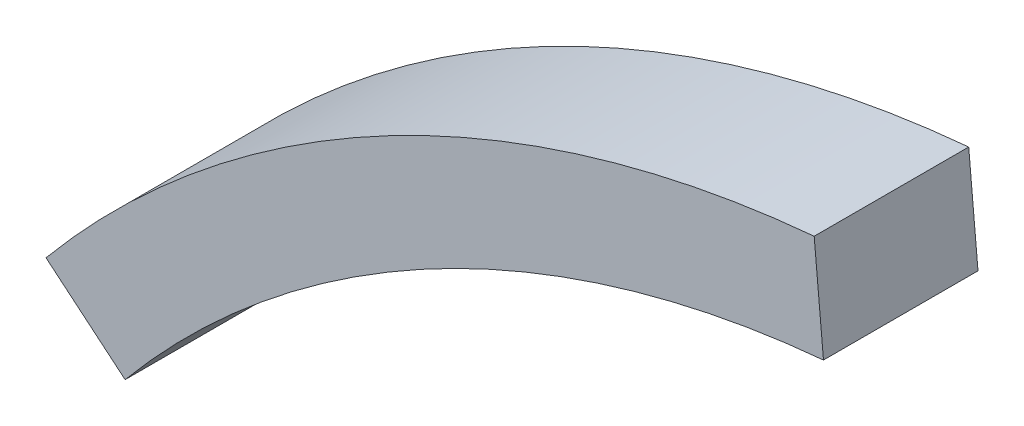
ISO-10303-21;
HEADER;
FILE_DESCRIPTION(('STEP AP214'),'2;1');
FILE_NAME('part.step','',(''),(''),'','','');
FILE_SCHEMA(('AUTOMOTIVE_DESIGN { 1 0 10303 214 1 1 1 1 }'));
ENDSEC;
DATA;
#1=APPLICATION_CONTEXT('core data for automotive mechanical design processes');
#2=APPLICATION_PROTOCOL_DEFINITION('international standard','automotive_design',2000,#1);
#3=PRODUCT_CONTEXT('',#1,'mechanical');
#4=PRODUCT('Part','Part','',(#3));
#5=PRODUCT_RELATED_PRODUCT_CATEGORY('part','',(#4));
#6=PRODUCT_DEFINITION_FORMATION('','',#4);
#7=PRODUCT_DEFINITION_CONTEXT('part definition',#1,'design');
#8=PRODUCT_DEFINITION('design','',#6,#7);
#9=PRODUCT_DEFINITION_SHAPE('','',#8);
#10=(LENGTH_UNIT() NAMED_UNIT(*) SI_UNIT(.MILLI.,.METRE.));
#11=(NAMED_UNIT(*) PLANE_ANGLE_UNIT() SI_UNIT($,.RADIAN.));
#12=(NAMED_UNIT(*) SI_UNIT($,.STERADIAN.) SOLID_ANGLE_UNIT());
#13=UNCERTAINTY_MEASURE_WITH_UNIT(LENGTH_MEASURE(1.E-05),#10,'distance_accuracy_value','');
#14=(GEOMETRIC_REPRESENTATION_CONTEXT(3) GLOBAL_UNCERTAINTY_ASSIGNED_CONTEXT((#13)) GLOBAL_UNIT_ASSIGNED_CONTEXT((#10,
#11,#12)) REPRESENTATION_CONTEXT('',''));
#15=CARTESIAN_POINT('',(0.,0.,0.));
#16=DIRECTION('',(0.,0.,1.));
#17=DIRECTION('',(1.,0.,0.));
#18=AXIS2_PLACEMENT_3D('',#15,#16,#17);
#19=CARTESIAN_POINT('',(0.,0.,3.));
#20=DIRECTION('',(0.,0.,-1.));
#21=DIRECTION('',(-1.,0.,0.));
#22=AXIS2_PLACEMENT_3D('',#19,#20,#21);
#23=CYLINDRICAL_SURFACE('',#22,20.);
#24=CARTESIAN_POINT('',(0.,0.,0.));
#25=DIRECTION('',(0.,0.,-1.));
#26=DIRECTION('',(1.,0.,0.));
#27=AXIS2_PLACEMENT_3D('',#24,#25,#26);
#28=CIRCLE('',#27,20.);
#29=CARTESIAN_POINT('',(-15.3584576206591,12.8108461669953,0.));
#30=VERTEX_POINT('',#29);
#31=CARTESIAN_POINT('',(-1.80143333471418,19.9187057295543,0.));
#32=VERTEX_POINT('',#31);
#33=EDGE_CURVE('E96',#30,#32,#28,.T.);
#34=ORIENTED_EDGE('',*,*,#33,.T.);
#35=DIRECTION('',(0.,0.,-1.));
#36=VECTOR('',#35,1.);
#37=CARTESIAN_POINT('',(-1.80143333471418,19.9187057295543,3.));
#38=LINE('',#37,#36);
#39=CARTESIAN_POINT('',(-1.80143333471418,19.9187057295543,3.));
#40=VERTEX_POINT('',#39);
#41=EDGE_CURVE('E11',#40,#32,#38,.T.);
#42=ORIENTED_EDGE('',*,*,#41,.F.);
#43=CARTESIAN_POINT('',(0.,0.,3.));
#44=DIRECTION('',(0.,0.,-1.));
#45=DIRECTION('',(1.,0.,0.));
#46=AXIS2_PLACEMENT_3D('',#43,#44,#45);
#47=CIRCLE('',#46,20.);
#48=CARTESIAN_POINT('',(-15.3584576206591,12.8108461669953,3.));
#49=VERTEX_POINT('',#48);
#50=EDGE_CURVE('E84',#49,#40,#47,.T.);
#51=ORIENTED_EDGE('',*,*,#50,.F.);
#52=DIRECTION('',(0.,0.,-1.));
#53=VECTOR('',#52,1.);
#54=CARTESIAN_POINT('',(-15.3584576206591,12.8108461669953,3.));
#55=LINE('',#54,#53);
#56=EDGE_CURVE('E92',#49,#30,#55,.T.);
#57=ORIENTED_EDGE('',*,*,#56,.T.);
#58=EDGE_LOOP('',(#34,#42,#51,#57));
#59=FACE_BOUND('',#58,.T.);
#60=ADVANCED_FACE('F33',(#59),#23,.F.);
#61=CARTESIAN_POINT('',(-1.80143333471418,19.9187057295543,3.));
#62=DIRECTION('',(-0.995935286477717,-0.0900716667357088,0.));
#63=DIRECTION('',(0.0900716667357088,-0.995935286477717,0.));
#64=AXIS2_PLACEMENT_3D('',#61,#62,#63);
#65=PLANE('',#64);
#66=DIRECTION('',(-0.0900716667357088,0.995935286477717,0.));
#67=VECTOR('',#66,1.);
#68=CARTESIAN_POINT('',(-1.80143333471418,19.9187057295543,0.));
#69=LINE('',#68,#67);
#70=CARTESIAN_POINT('',(-1.98157666818559,21.9105763025098,0.));
#71=VERTEX_POINT('',#70);
#72=EDGE_CURVE('E88',#32,#71,#69,.T.);
#73=ORIENTED_EDGE('',*,*,#72,.T.);
#74=DIRECTION('',(0.,0.,-1.));
#75=VECTOR('',#74,1.);
#76=CARTESIAN_POINT('',(-1.98157666818559,21.9105763025098,3.));
#77=LINE('',#76,#75);
#78=CARTESIAN_POINT('',(-1.98157666818559,21.9105763025098,3.));
#79=VERTEX_POINT('',#78);
#80=EDGE_CURVE('E41',#79,#71,#77,.T.);
#81=ORIENTED_EDGE('',*,*,#80,.F.);
#82=DIRECTION('',(-0.0900716667357088,0.995935286477717,0.));
#83=VECTOR('',#82,1.);
#84=CARTESIAN_POINT('',(-1.80143333471418,19.9187057295543,3.));
#85=LINE('',#84,#83);
#86=EDGE_CURVE('E79',#40,#79,#85,.T.);
#87=ORIENTED_EDGE('',*,*,#86,.F.);
#88=ORIENTED_EDGE('',*,*,#41,.T.);
#89=EDGE_LOOP('',(#73,#81,#87,#88));
#90=FACE_BOUND('',#89,.T.);
#91=ADVANCED_FACE('F87',(#90),#65,.F.);
#92=CARTESIAN_POINT('',(0.,0.,3.));
#93=DIRECTION('',(0.,0.,-1.));
#94=DIRECTION('',(-1.,0.,0.));
#95=AXIS2_PLACEMENT_3D('',#92,#93,#94);
#96=CYLINDRICAL_SURFACE('',#95,22.);
#97=CARTESIAN_POINT('',(0.,0.,0.));
#98=DIRECTION('',(0.,0.,1.));
#99=DIRECTION('',(1.,0.,0.));
#100=AXIS2_PLACEMENT_3D('',#97,#98,#99);
#101=CIRCLE('',#100,22.);
#102=CARTESIAN_POINT('',(-16.894303382725,14.0919307836948,0.));
#103=VERTEX_POINT('',#102);
#104=EDGE_CURVE('E66',#71,#103,#101,.T.);
#105=ORIENTED_EDGE('',*,*,#104,.T.);
#106=DIRECTION('',(0.,0.,-1.));
#107=VECTOR('',#106,1.);
#108=CARTESIAN_POINT('',(-16.894303382725,14.0919307836948,3.));
#109=LINE('',#108,#107);
#110=CARTESIAN_POINT('',(-16.894303382725,14.0919307836948,3.));
#111=VERTEX_POINT('',#110);
#112=EDGE_CURVE('E89',#111,#103,#109,.T.);
#113=ORIENTED_EDGE('',*,*,#112,.F.);
#114=CARTESIAN_POINT('',(0.,0.,3.));
#115=DIRECTION('',(0.,0.,1.));
#116=DIRECTION('',(1.,0.,0.));
#117=AXIS2_PLACEMENT_3D('',#114,#115,#116);
#118=CIRCLE('',#117,22.);
#119=EDGE_CURVE('E82',#79,#111,#118,.T.);
#120=ORIENTED_EDGE('',*,*,#119,.F.);
#121=ORIENTED_EDGE('',*,*,#80,.T.);
#122=EDGE_LOOP('',(#105,#113,#120,#121));
#123=FACE_BOUND('',#122,.T.);
#124=ADVANCED_FACE('F90',(#123),#96,.T.);
#125=CARTESIAN_POINT('',(-15.3584576206591,12.8108461669953,3.));
#126=DIRECTION('',(0.640542308349764,0.767922881032956,0.));
#127=DIRECTION('',(-0.767922881032956,0.640542308349764,0.));
#128=AXIS2_PLACEMENT_3D('',#125,#126,#127);
#129=PLANE('',#128);
#130=DIRECTION('',(0.767922881032956,-0.640542308349764,0.));
#131=VECTOR('',#130,1.);
#132=CARTESIAN_POINT('',(-15.3584576206591,12.8108461669953,0.));
#133=LINE('',#132,#131);
#134=EDGE_CURVE('E72',#103,#30,#133,.T.);
#135=ORIENTED_EDGE('',*,*,#134,.T.);
#136=ORIENTED_EDGE('',*,*,#56,.F.);
#137=DIRECTION('',(0.767922881032956,-0.640542308349764,0.));
#138=VECTOR('',#137,1.);
#139=CARTESIAN_POINT('',(-15.3584576206591,12.8108461669953,3.));
#140=LINE('',#139,#138);
#141=EDGE_CURVE('E49',#111,#49,#140,.T.);
#142=ORIENTED_EDGE('',*,*,#141,.F.);
#143=ORIENTED_EDGE('',*,*,#112,.T.);
#144=EDGE_LOOP('',(#135,#136,#142,#143));
#145=FACE_BOUND('',#144,.T.);
#146=ADVANCED_FACE('F103',(#145),#129,.F.);
#147=CARTESIAN_POINT('',(0.,0.,3.));
#148=DIRECTION('',(0.,0.,1.));
#149=DIRECTION('',(1.,0.,0.));
#150=AXIS2_PLACEMENT_3D('',#147,#148,#149);
#151=PLANE('',#150);
#152=ORIENTED_EDGE('',*,*,#50,.T.);
#153=ORIENTED_EDGE('',*,*,#86,.T.);
#154=ORIENTED_EDGE('',*,*,#119,.T.);
#155=ORIENTED_EDGE('',*,*,#141,.T.);
#156=EDGE_LOOP('',(#152,#153,#154,#155));
#157=FACE_BOUND('',#156,.T.);
#158=ADVANCED_FACE('F80',(#157),#151,.T.);
#159=CARTESIAN_POINT('',(0.,0.,0.));
#160=DIRECTION('',(0.,0.,1.));
#161=DIRECTION('',(1.,0.,0.));
#162=AXIS2_PLACEMENT_3D('',#159,#160,#161);
#163=PLANE('',#162);
#164=ORIENTED_EDGE('',*,*,#33,.F.);
#165=ORIENTED_EDGE('',*,*,#134,.F.);
#166=ORIENTED_EDGE('',*,*,#104,.F.);
#167=ORIENTED_EDGE('',*,*,#72,.F.);
#168=EDGE_LOOP('',(#164,#165,#166,#167));
#169=FACE_BOUND('',#168,.T.);
#170=ADVANCED_FACE('F106',(#169),#163,.F.);
#171=CLOSED_SHELL('',(#60,#91,#124,#146,#158,#170));
#172=MANIFOLD_SOLID_BREP('B2',#171);
#173=ADVANCED_BREP_SHAPE_REPRESENTATION('',(#18,#172),#14);
#174=SHAPE_DEFINITION_REPRESENTATION(#9,#173);
ENDSEC;
END-ISO-10303-21;
